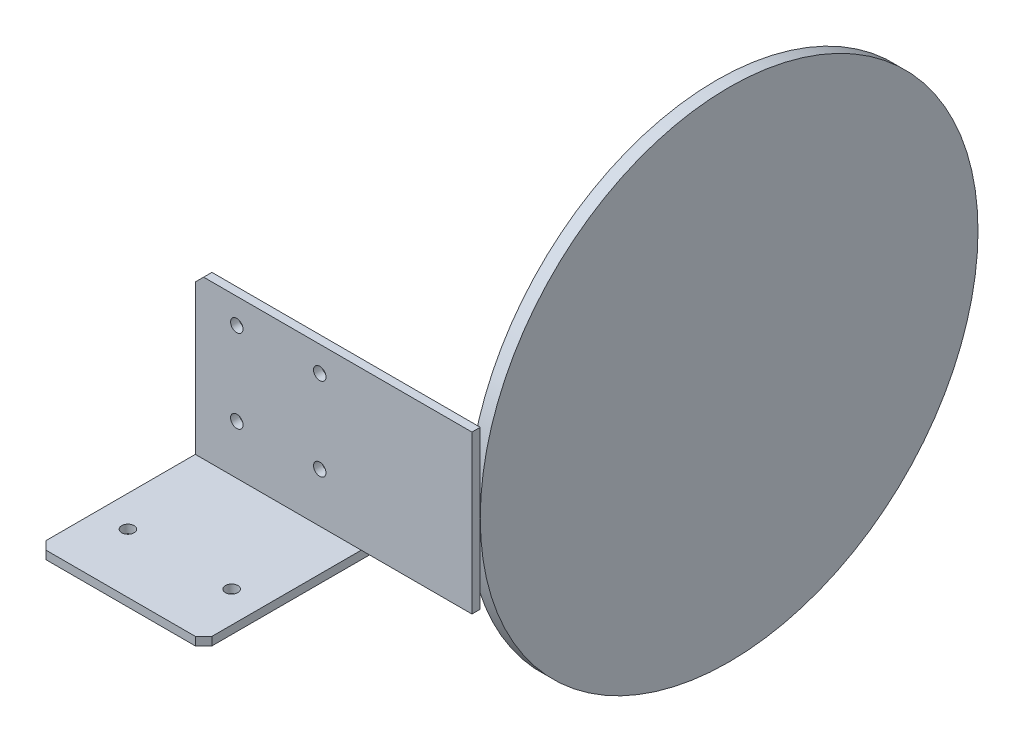
ISO-10303-21;
HEADER;
FILE_DESCRIPTION(('STEP AP214'),'2;1');
FILE_NAME('part.step','',(''),(''),'','','');
FILE_SCHEMA(('AUTOMOTIVE_DESIGN { 1 0 10303 214 1 1 1 1 }'));
ENDSEC;
DATA;
#1=APPLICATION_CONTEXT('core data for automotive mechanical design processes');
#2=APPLICATION_PROTOCOL_DEFINITION('international standard','automotive_design',2000,#1);
#3=PRODUCT_CONTEXT('',#1,'mechanical');
#4=PRODUCT('Part','Part','',(#3));
#5=PRODUCT_RELATED_PRODUCT_CATEGORY('part','',(#4));
#6=PRODUCT_DEFINITION_FORMATION('','',#4);
#7=PRODUCT_DEFINITION_CONTEXT('part definition',#1,'design');
#8=PRODUCT_DEFINITION('design','',#6,#7);
#9=PRODUCT_DEFINITION_SHAPE('','',#8);
#10=(LENGTH_UNIT() NAMED_UNIT(*) SI_UNIT(.MILLI.,.METRE.));
#11=(NAMED_UNIT(*) PLANE_ANGLE_UNIT() SI_UNIT($,.RADIAN.));
#12=(NAMED_UNIT(*) SI_UNIT($,.STERADIAN.) SOLID_ANGLE_UNIT());
#13=UNCERTAINTY_MEASURE_WITH_UNIT(LENGTH_MEASURE(1.E-05),#10,'distance_accuracy_value','');
#14=(GEOMETRIC_REPRESENTATION_CONTEXT(3) GLOBAL_UNCERTAINTY_ASSIGNED_CONTEXT((#13)) GLOBAL_UNIT_ASSIGNED_CONTEXT((#10,
#11,#12)) REPRESENTATION_CONTEXT('',''));
#15=CARTESIAN_POINT('',(0.,0.,0.));
#16=DIRECTION('',(0.,0.,1.));
#17=DIRECTION('',(1.,0.,0.));
#18=AXIS2_PLACEMENT_3D('',#15,#16,#17);
#19=CARTESIAN_POINT('',(63.69,19.,-62.));
#20=DIRECTION('',(1.,0.,0.));
#21=DIRECTION('',(0.,0.,-1.));
#22=AXIS2_PLACEMENT_3D('',#19,#20,#21);
#23=CYLINDRICAL_SURFACE('',#22,59.9999999999999);
#24=CARTESIAN_POINT('',(63.69,19.,-62.));
#25=DIRECTION('',(1.,0.,0.));
#26=DIRECTION('',(0.,0.,-1.));
#27=AXIS2_PLACEMENT_3D('',#24,#25,#26);
#28=CIRCLE('',#27,59.9999999999999);
#29=CARTESIAN_POINT('',(63.69,19.,-122.));
#30=VERTEX_POINT('',#29);
#31=EDGE_CURVE('E11',#30,#30,#28,.T.);
#32=ORIENTED_EDGE('',*,*,#31,.T.);
#33=EDGE_LOOP('',(#32));
#34=FACE_BOUND('',#33,.T.);
#35=CARTESIAN_POINT('',(66.69,19.,-62.));
#36=DIRECTION('',(1.,0.,0.));
#37=DIRECTION('',(0.,0.,-1.));
#38=AXIS2_PLACEMENT_3D('',#35,#36,#37);
#39=CIRCLE('',#38,59.9999999999999);
#40=CARTESIAN_POINT('',(66.69,19.,-122.));
#41=VERTEX_POINT('',#40);
#42=EDGE_CURVE('E46',#41,#41,#39,.T.);
#43=ORIENTED_EDGE('',*,*,#42,.F.);
#44=EDGE_LOOP('',(#43));
#45=FACE_BOUND('',#44,.T.);
#46=ADVANCED_FACE('F43',(#34,#45),#23,.T.);
#47=CARTESIAN_POINT('',(63.69,19.,-62.));
#48=DIRECTION('',(1.,0.,0.));
#49=DIRECTION('',(0.,0.,-1.));
#50=AXIS2_PLACEMENT_3D('',#47,#48,#49);
#51=PLANE('',#50);
#52=ORIENTED_EDGE('',*,*,#31,.F.);
#53=EDGE_LOOP('',(#52));
#54=FACE_BOUND('',#53,.T.);
#55=ADVANCED_FACE('F58',(#54),#51,.F.);
#56=CARTESIAN_POINT('',(66.69,19.,-62.));
#57=DIRECTION('',(1.,0.,0.));
#58=DIRECTION('',(0.,0.,-1.));
#59=AXIS2_PLACEMENT_3D('',#56,#57,#58);
#60=PLANE('',#59);
#61=ORIENTED_EDGE('',*,*,#42,.T.);
#62=EDGE_LOOP('',(#61));
#63=FACE_BOUND('',#62,.T.);
#64=ADVANCED_FACE('F55',(#63),#60,.T.);
#65=CLOSED_SHELL('',(#46,#55,#64));
#66=MANIFOLD_SOLID_BREP('B2',#65);
#67=CARTESIAN_POINT('',(40.,0.,38.));
#68=DIRECTION('',(0.,-1.,0.));
#69=DIRECTION('',(0.,0.,-1.));
#70=AXIS2_PLACEMENT_3D('',#67,#68,#69);
#71=PLANE('',#70);
#72=CARTESIAN_POINT('',(7.5,0.,23.75));
#73=DIRECTION('',(0.,-1.,0.));
#74=DIRECTION('',(0.,0.,-1.));
#75=AXIS2_PLACEMENT_3D('',#72,#73,#74);
#76=CIRCLE('',#75,1.49999999997635);
#77=CARTESIAN_POINT('',(7.5,0.,22.2500000000236));
#78=VERTEX_POINT('',#77);
#79=EDGE_CURVE('E219',#78,#78,#76,.F.);
#80=ORIENTED_EDGE('',*,*,#79,.F.);
#81=EDGE_LOOP('',(#80));
#82=FACE_BOUND('',#81,.T.);
#83=CARTESIAN_POINT('',(32.5,0.,23.75));
#84=DIRECTION('',(0.,-1.,0.));
#85=DIRECTION('',(0.,0.,-1.));
#86=AXIS2_PLACEMENT_3D('',#83,#84,#85);
#87=CIRCLE('',#86,1.49999999997635);
#88=CARTESIAN_POINT('',(32.5,0.,22.2500000000236));
#89=VERTEX_POINT('',#88);
#90=EDGE_CURVE('E225',#89,#89,#87,.F.);
#91=ORIENTED_EDGE('',*,*,#90,.F.);
#92=EDGE_LOOP('',(#91));
#93=FACE_BOUND('',#92,.T.);
#94=DIRECTION('',(-1.,0.,0.));
#95=VECTOR('',#94,1.);
#96=CARTESIAN_POINT('',(40.,0.,38.));
#97=LINE('',#96,#95);
#98=CARTESIAN_POINT('',(38.,0.,38.));
#99=VERTEX_POINT('',#98);
#100=CARTESIAN_POINT('',(2.00000000000001,0.,38.));
#101=VERTEX_POINT('',#100);
#102=EDGE_CURVE('E255',#99,#101,#97,.T.);
#103=ORIENTED_EDGE('',*,*,#102,.F.);
#104=DIRECTION('',(0.70710678118655,0.,-0.707106781186545));
#105=VECTOR('',#104,1.);
#106=CARTESIAN_POINT('',(40.,0.,36.));
#107=LINE('',#106,#105);
#108=CARTESIAN_POINT('',(40.,0.,36.));
#109=VERTEX_POINT('',#108);
#110=EDGE_CURVE('E272',#99,#109,#107,.T.);
#111=ORIENTED_EDGE('',*,*,#110,.T.);
#112=DIRECTION('',(0.,0.,1.));
#113=VECTOR('',#112,1.);
#114=CARTESIAN_POINT('',(40.,0.,38.));
#115=LINE('',#114,#113);
#116=CARTESIAN_POINT('',(40.,0.,0.));
#117=VERTEX_POINT('',#116);
#118=EDGE_CURVE('E229',#117,#109,#115,.T.);
#119=ORIENTED_EDGE('',*,*,#118,.F.);
#120=DIRECTION('',(-1.,0.,0.));
#121=VECTOR('',#120,1.);
#122=CARTESIAN_POINT('',(40.,0.,0.));
#123=LINE('',#122,#121);
#124=CARTESIAN_POINT('',(0.,0.,0.));
#125=VERTEX_POINT('',#124);
#126=EDGE_CURVE('E169',#117,#125,#123,.T.);
#127=ORIENTED_EDGE('',*,*,#126,.T.);
#128=DIRECTION('',(0.,0.,1.));
#129=VECTOR('',#128,1.);
#130=CARTESIAN_POINT('',(0.,0.,38.));
#131=LINE('',#130,#129);
#132=CARTESIAN_POINT('',(0.,0.,36.));
#133=VERTEX_POINT('',#132);
#134=EDGE_CURVE('E228',#125,#133,#131,.T.);
#135=ORIENTED_EDGE('',*,*,#134,.T.);
#136=DIRECTION('',(-0.707106781186545,0.,-0.70710678118655));
#137=VECTOR('',#136,1.);
#138=CARTESIAN_POINT('',(1.99999999999999,0.,38.));
#139=LINE('',#138,#137);
#140=EDGE_CURVE('E270',#133,#101,#139,.F.);
#141=ORIENTED_EDGE('',*,*,#140,.T.);
#142=EDGE_LOOP('',(#103,#111,#119,#127,#135,#141));
#143=FACE_BOUND('',#142,.T.);
#144=ADVANCED_FACE('F84',(#82,#93,#143),#71,.F.);
#145=CARTESIAN_POINT('',(40.,-2.,38.));
#146=DIRECTION('',(0.,0.,-1.));
#147=DIRECTION('',(-1.,0.,0.));
#148=AXIS2_PLACEMENT_3D('',#145,#146,#147);
#149=PLANE('',#148);
#150=DIRECTION('',(-1.,0.,0.));
#151=VECTOR('',#150,1.);
#152=CARTESIAN_POINT('',(40.,-2.,38.));
#153=LINE('',#152,#151);
#154=CARTESIAN_POINT('',(38.,-2.,38.));
#155=VERTEX_POINT('',#154);
#156=CARTESIAN_POINT('',(2.00000000000001,-2.,38.));
#157=VERTEX_POINT('',#156);
#158=EDGE_CURVE('E252',#155,#157,#153,.T.);
#159=ORIENTED_EDGE('',*,*,#158,.F.);
#160=DIRECTION('',(0.,1.,0.));
#161=VECTOR('',#160,1.);
#162=CARTESIAN_POINT('',(38.,0.,38.));
#163=LINE('',#162,#161);
#164=EDGE_CURVE('E268',#155,#99,#163,.T.);
#165=ORIENTED_EDGE('',*,*,#164,.T.);
#166=ORIENTED_EDGE('',*,*,#102,.T.);
#167=DIRECTION('',(0.,-1.,0.));
#168=VECTOR('',#167,1.);
#169=CARTESIAN_POINT('',(1.99999999999999,-2.,38.));
#170=LINE('',#169,#168);
#171=EDGE_CURVE('E265',#101,#157,#170,.T.);
#172=ORIENTED_EDGE('',*,*,#171,.T.);
#173=EDGE_LOOP('',(#159,#165,#166,#172));
#174=FACE_BOUND('',#173,.T.);
#175=ADVANCED_FACE('F301',(#174),#149,.F.);
#176=CARTESIAN_POINT('',(40.,-2.,-2.00000000000001));
#177=DIRECTION('',(0.,1.,0.));
#178=DIRECTION('',(0.,0.,1.));
#179=AXIS2_PLACEMENT_3D('',#176,#177,#178);
#180=PLANE('',#179);
#181=CARTESIAN_POINT('',(7.5,-2.,23.75));
#182=DIRECTION('',(0.,-1.,0.));
#183=DIRECTION('',(0.,0.,-1.));
#184=AXIS2_PLACEMENT_3D('',#181,#182,#183);
#185=CIRCLE('',#184,1.49999999997635);
#186=CARTESIAN_POINT('',(7.5,-2.,22.2500000000236));
#187=VERTEX_POINT('',#186);
#188=EDGE_CURVE('E216',#187,#187,#185,.T.);
#189=ORIENTED_EDGE('',*,*,#188,.F.);
#190=EDGE_LOOP('',(#189));
#191=FACE_BOUND('',#190,.T.);
#192=CARTESIAN_POINT('',(32.5,-2.,23.75));
#193=DIRECTION('',(0.,-1.,0.));
#194=DIRECTION('',(0.,0.,-1.));
#195=AXIS2_PLACEMENT_3D('',#192,#193,#194);
#196=CIRCLE('',#195,1.49999999997635);
#197=CARTESIAN_POINT('',(32.5,-2.,22.2500000000236));
#198=VERTEX_POINT('',#197);
#199=EDGE_CURVE('E222',#198,#198,#196,.T.);
#200=ORIENTED_EDGE('',*,*,#199,.F.);
#201=EDGE_LOOP('',(#200));
#202=FACE_BOUND('',#201,.T.);
#203=DIRECTION('',(0.,0.,-1.));
#204=VECTOR('',#203,1.);
#205=CARTESIAN_POINT('',(40.,-2.,-2.00000000000001));
#206=LINE('',#205,#204);
#207=CARTESIAN_POINT('',(40.,-2.,36.));
#208=VERTEX_POINT('',#207);
#209=CARTESIAN_POINT('',(40.,-2.,-2.00000000000001));
#210=VERTEX_POINT('',#209);
#211=EDGE_CURVE('E232',#208,#210,#206,.T.);
#212=ORIENTED_EDGE('',*,*,#211,.F.);
#213=DIRECTION('',(-0.70710678118655,0.,0.707106781186545));
#214=VECTOR('',#213,1.);
#215=CARTESIAN_POINT('',(40.,-2.,36.));
#216=LINE('',#215,#214);
#217=EDGE_CURVE('E263',#208,#155,#216,.T.);
#218=ORIENTED_EDGE('',*,*,#217,.T.);
#219=ORIENTED_EDGE('',*,*,#158,.T.);
#220=DIRECTION('',(0.707106781186545,0.,0.70710678118655));
#221=VECTOR('',#220,1.);
#222=CARTESIAN_POINT('',(1.99999999999999,-2.,38.));
#223=LINE('',#222,#221);
#224=CARTESIAN_POINT('',(0.,-2.,36.));
#225=VERTEX_POINT('',#224);
#226=EDGE_CURVE('E261',#157,#225,#223,.F.);
#227=ORIENTED_EDGE('',*,*,#226,.T.);
#228=DIRECTION('',(0.,0.,-1.));
#229=VECTOR('',#228,1.);
#230=CARTESIAN_POINT('',(0.,-2.,-2.00000000000001));
#231=LINE('',#230,#229);
#232=CARTESIAN_POINT('',(0.,-2.,-2.00000000000001));
#233=VERTEX_POINT('',#232);
#234=EDGE_CURVE('E240',#225,#233,#231,.T.);
#235=ORIENTED_EDGE('',*,*,#234,.T.);
#236=DIRECTION('',(-1.,0.,0.));
#237=VECTOR('',#236,1.);
#238=CARTESIAN_POINT('',(40.,-2.,-2.00000000000001));
#239=LINE('',#238,#237);
#240=EDGE_CURVE('E249',#210,#233,#239,.T.);
#241=ORIENTED_EDGE('',*,*,#240,.F.);
#242=EDGE_LOOP('',(#212,#218,#219,#227,#235,#241));
#243=FACE_BOUND('',#242,.T.);
#244=ADVANCED_FACE('F298',(#191,#202,#243),#180,.F.);
#245=CARTESIAN_POINT('',(40.,38.,-2.));
#246=DIRECTION('',(0.,0.,1.));
#247=DIRECTION('',(0.,-1.,0.));
#248=AXIS2_PLACEMENT_3D('',#245,#246,#247);
#249=PLANE('',#248);
#250=DIRECTION('',(1.,0.,0.));
#251=VECTOR('',#250,1.);
#252=CARTESIAN_POINT('',(37.,0.,-2.00000000000001));
#253=LINE('',#252,#251);
#254=CARTESIAN_POINT('',(40.,0.,-2.00000000000001));
#255=VERTEX_POINT('',#254);
#256=CARTESIAN_POINT('',(66.69,0.,-2.00000000000001));
#257=VERTEX_POINT('',#256);
#258=EDGE_CURVE('E173',#255,#257,#253,.T.);
#259=ORIENTED_EDGE('',*,*,#258,.F.);
#260=DIRECTION('',(0.,1.,0.));
#261=VECTOR('',#260,1.);
#262=CARTESIAN_POINT('',(40.,38.,-2.));
#263=LINE('',#262,#261);
#264=EDGE_CURVE('E235',#210,#255,#263,.T.);
#265=ORIENTED_EDGE('',*,*,#264,.F.);
#266=ORIENTED_EDGE('',*,*,#240,.T.);
#267=DIRECTION('',(0.,1.,0.));
#268=VECTOR('',#267,1.);
#269=CARTESIAN_POINT('',(0.,38.,-2.));
#270=LINE('',#269,#268);
#271=CARTESIAN_POINT('',(0.,36.,-2.));
#272=VERTEX_POINT('',#271);
#273=EDGE_CURVE('E242',#233,#272,#270,.T.);
#274=ORIENTED_EDGE('',*,*,#273,.T.);
#275=DIRECTION('',(-0.707106781186545,-0.70710678118655,0.));
#276=VECTOR('',#275,1.);
#277=CARTESIAN_POINT('',(1.99999999999999,38.,-2.));
#278=LINE('',#277,#276);
#279=CARTESIAN_POINT('',(2.00000000000001,38.,-2.));
#280=VERTEX_POINT('',#279);
#281=EDGE_CURVE('E92',#272,#280,#278,.F.);
#282=ORIENTED_EDGE('',*,*,#281,.T.);
#283=DIRECTION('',(-1.,0.,0.));
#284=VECTOR('',#283,1.);
#285=CARTESIAN_POINT('',(40.,38.,-2.));
#286=LINE('',#285,#284);
#287=CARTESIAN_POINT('',(66.69,38.,-2.00000000000001));
#288=VERTEX_POINT('',#287);
#289=EDGE_CURVE('E99',#288,#280,#286,.T.);
#290=ORIENTED_EDGE('',*,*,#289,.F.);
#291=DIRECTION('',(0.,1.,0.));
#292=VECTOR('',#291,1.);
#293=CARTESIAN_POINT('',(66.69,38.,-2.00000000000001));
#294=LINE('',#293,#292);
#295=EDGE_CURVE('E183',#257,#288,#294,.T.);
#296=ORIENTED_EDGE('',*,*,#295,.F.);
#297=EDGE_LOOP('',(#259,#265,#266,#274,#282,#290,#296));
#298=FACE_BOUND('',#297,.T.);
#299=CARTESIAN_POINT('',(9.99999999999981,11.9,-2.));
#300=DIRECTION('',(0.,0.,-1.));
#301=DIRECTION('',(0.,1.,0.));
#302=AXIS2_PLACEMENT_3D('',#299,#300,#301);
#303=CIRCLE('',#302,1.5);
#304=CARTESIAN_POINT('',(9.99999999999981,13.4,-2.));
#305=VERTEX_POINT('',#304);
#306=EDGE_CURVE('E191',#305,#305,#303,.T.);
#307=ORIENTED_EDGE('',*,*,#306,.F.);
#308=EDGE_LOOP('',(#307));
#309=FACE_BOUND('',#308,.T.);
#310=CARTESIAN_POINT('',(29.9999999999998,11.8999999999999,-2.));
#311=DIRECTION('',(0.,0.,-1.));
#312=DIRECTION('',(0.,1.,0.));
#313=AXIS2_PLACEMENT_3D('',#310,#311,#312);
#314=CIRCLE('',#313,1.5);
#315=CARTESIAN_POINT('',(29.9999999999998,13.3999999999999,-2.));
#316=VERTEX_POINT('',#315);
#317=EDGE_CURVE('E198',#316,#316,#314,.T.);
#318=ORIENTED_EDGE('',*,*,#317,.F.);
#319=EDGE_LOOP('',(#318));
#320=FACE_BOUND('',#319,.T.);
#321=CARTESIAN_POINT('',(30.,31.8999999999999,-2.));
#322=DIRECTION('',(0.,0.,-1.));
#323=DIRECTION('',(0.,1.,0.));
#324=AXIS2_PLACEMENT_3D('',#321,#322,#323);
#325=CIRCLE('',#324,1.5);
#326=CARTESIAN_POINT('',(30.,33.3999999999999,-2.));
#327=VERTEX_POINT('',#326);
#328=EDGE_CURVE('E204',#327,#327,#325,.T.);
#329=ORIENTED_EDGE('',*,*,#328,.F.);
#330=EDGE_LOOP('',(#329));
#331=FACE_BOUND('',#330,.T.);
#332=CARTESIAN_POINT('',(10.,31.9,-2.));
#333=DIRECTION('',(0.,0.,-1.));
#334=DIRECTION('',(0.,1.,0.));
#335=AXIS2_PLACEMENT_3D('',#332,#333,#334);
#336=CIRCLE('',#335,1.5);
#337=CARTESIAN_POINT('',(10.,33.4,-2.));
#338=VERTEX_POINT('',#337);
#339=EDGE_CURVE('E210',#338,#338,#336,.T.);
#340=ORIENTED_EDGE('',*,*,#339,.F.);
#341=EDGE_LOOP('',(#340));
#342=FACE_BOUND('',#341,.T.);
#343=ADVANCED_FACE('F284',(#298,#309,#320,#331,#342),#249,.F.);
#344=CARTESIAN_POINT('',(40.,38.,0.));
#345=DIRECTION('',(0.,-1.,0.));
#346=DIRECTION('',(0.,0.,-1.));
#347=AXIS2_PLACEMENT_3D('',#344,#345,#346);
#348=PLANE('',#347);
#349=ORIENTED_EDGE('',*,*,#289,.T.);
#350=DIRECTION('',(0.,0.,1.));
#351=VECTOR('',#350,1.);
#352=CARTESIAN_POINT('',(1.99999999999999,38.,0.));
#353=LINE('',#352,#351);
#354=CARTESIAN_POINT('',(2.00000000000001,38.,0.));
#355=VERTEX_POINT('',#354);
#356=EDGE_CURVE('E278',#280,#355,#353,.T.);
#357=ORIENTED_EDGE('',*,*,#356,.T.);
#358=DIRECTION('',(-1.,0.,0.));
#359=VECTOR('',#358,1.);
#360=CARTESIAN_POINT('',(40.,38.,0.));
#361=LINE('',#360,#359);
#362=CARTESIAN_POINT('',(66.69,38.,0.));
#363=VERTEX_POINT('',#362);
#364=EDGE_CURVE('E107',#363,#355,#361,.T.);
#365=ORIENTED_EDGE('',*,*,#364,.F.);
#366=DIRECTION('',(0.,0.,1.));
#367=VECTOR('',#366,1.);
#368=CARTESIAN_POINT('',(66.69,38.,0.));
#369=LINE('',#368,#367);
#370=EDGE_CURVE('E174',#288,#363,#369,.T.);
#371=ORIENTED_EDGE('',*,*,#370,.F.);
#372=EDGE_LOOP('',(#349,#357,#365,#371));
#373=FACE_BOUND('',#372,.T.);
#374=ADVANCED_FACE('F289',(#373),#348,.F.);
#375=CARTESIAN_POINT('',(40.,0.,0.));
#376=DIRECTION('',(0.,0.,-1.));
#377=DIRECTION('',(-1.,0.,0.));
#378=AXIS2_PLACEMENT_3D('',#375,#376,#377);
#379=PLANE('',#378);
#380=ORIENTED_EDGE('',*,*,#126,.F.);
#381=DIRECTION('',(1.,0.,0.));
#382=VECTOR('',#381,1.);
#383=CARTESIAN_POINT('',(37.,0.,0.));
#384=LINE('',#383,#382);
#385=CARTESIAN_POINT('',(66.69,0.,0.));
#386=VERTEX_POINT('',#385);
#387=EDGE_CURVE('E162',#117,#386,#384,.T.);
#388=ORIENTED_EDGE('',*,*,#387,.T.);
#389=DIRECTION('',(0.,-1.,0.));
#390=VECTOR('',#389,1.);
#391=CARTESIAN_POINT('',(66.69,38.,0.));
#392=LINE('',#391,#390);
#393=EDGE_CURVE('E167',#363,#386,#392,.T.);
#394=ORIENTED_EDGE('',*,*,#393,.F.);
#395=ORIENTED_EDGE('',*,*,#364,.T.);
#396=DIRECTION('',(0.707106781186545,0.70710678118655,0.));
#397=VECTOR('',#396,1.);
#398=CARTESIAN_POINT('',(1.99999999999999,38.,0.));
#399=LINE('',#398,#397);
#400=CARTESIAN_POINT('',(0.,36.,0.));
#401=VERTEX_POINT('',#400);
#402=EDGE_CURVE('E280',#355,#401,#399,.F.);
#403=ORIENTED_EDGE('',*,*,#402,.T.);
#404=DIRECTION('',(0.,-1.,0.));
#405=VECTOR('',#404,1.);
#406=CARTESIAN_POINT('',(0.,0.,0.));
#407=LINE('',#406,#405);
#408=EDGE_CURVE('E233',#401,#125,#407,.T.);
#409=ORIENTED_EDGE('',*,*,#408,.T.);
#410=EDGE_LOOP('',(#380,#388,#394,#395,#403,#409));
#411=FACE_BOUND('',#410,.T.);
#412=CARTESIAN_POINT('',(10.,31.9,0.));
#413=DIRECTION('',(0.,0.,-1.));
#414=DIRECTION('',(-1.,0.,0.));
#415=AXIS2_PLACEMENT_3D('',#412,#413,#414);
#416=CIRCLE('',#415,1.5);
#417=CARTESIAN_POINT('',(8.50000000000001,31.9,0.));
#418=VERTEX_POINT('',#417);
#419=EDGE_CURVE('E213',#418,#418,#416,.F.);
#420=ORIENTED_EDGE('',*,*,#419,.F.);
#421=EDGE_LOOP('',(#420));
#422=FACE_BOUND('',#421,.T.);
#423=CARTESIAN_POINT('',(30.,31.8999999999999,0.));
#424=DIRECTION('',(0.,0.,-1.));
#425=DIRECTION('',(-1.,0.,0.));
#426=AXIS2_PLACEMENT_3D('',#423,#424,#425);
#427=CIRCLE('',#426,1.5);
#428=CARTESIAN_POINT('',(28.5,31.8999999999999,0.));
#429=VERTEX_POINT('',#428);
#430=EDGE_CURVE('E207',#429,#429,#427,.F.);
#431=ORIENTED_EDGE('',*,*,#430,.F.);
#432=EDGE_LOOP('',(#431));
#433=FACE_BOUND('',#432,.T.);
#434=CARTESIAN_POINT('',(29.9999999999998,11.8999999999999,0.));
#435=DIRECTION('',(0.,0.,-1.));
#436=DIRECTION('',(-1.,0.,0.));
#437=AXIS2_PLACEMENT_3D('',#434,#435,#436);
#438=CIRCLE('',#437,1.5);
#439=CARTESIAN_POINT('',(28.4999999999998,11.8999999999999,0.));
#440=VERTEX_POINT('',#439);
#441=EDGE_CURVE('E201',#440,#440,#438,.F.);
#442=ORIENTED_EDGE('',*,*,#441,.F.);
#443=EDGE_LOOP('',(#442));
#444=FACE_BOUND('',#443,.T.);
#445=CARTESIAN_POINT('',(9.99999999999981,11.9,0.));
#446=DIRECTION('',(0.,0.,-1.));
#447=DIRECTION('',(-1.,0.,0.));
#448=AXIS2_PLACEMENT_3D('',#445,#446,#447);
#449=CIRCLE('',#448,1.5);
#450=CARTESIAN_POINT('',(8.4999999999998,11.9,0.));
#451=VERTEX_POINT('',#450);
#452=EDGE_CURVE('E195',#451,#451,#449,.F.);
#453=ORIENTED_EDGE('',*,*,#452,.F.);
#454=EDGE_LOOP('',(#453));
#455=FACE_BOUND('',#454,.T.);
#456=ADVANCED_FACE('F164',(#411,#422,#433,#444,#455),#379,.F.);
#457=CARTESIAN_POINT('',(40.,0.,0.));
#458=DIRECTION('',(1.,0.,0.));
#459=DIRECTION('',(0.,0.,-1.));
#460=AXIS2_PLACEMENT_3D('',#457,#458,#459);
#461=PLANE('',#460);
#462=DIRECTION('',(0.,0.,-1.));
#463=VECTOR('',#462,1.);
#464=CARTESIAN_POINT('',(40.,0.,0.));
#465=LINE('',#464,#463);
#466=EDGE_CURVE('E41',#117,#255,#465,.T.);
#467=ORIENTED_EDGE('',*,*,#466,.F.);
#468=ORIENTED_EDGE('',*,*,#118,.T.);
#469=DIRECTION('',(0.,-1.,0.));
#470=VECTOR('',#469,1.);
#471=CARTESIAN_POINT('',(40.,-2.,36.));
#472=LINE('',#471,#470);
#473=EDGE_CURVE('E258',#109,#208,#472,.T.);
#474=ORIENTED_EDGE('',*,*,#473,.T.);
#475=ORIENTED_EDGE('',*,*,#211,.T.);
#476=ORIENTED_EDGE('',*,*,#264,.T.);
#477=EDGE_LOOP('',(#467,#468,#474,#475,#476));
#478=FACE_BOUND('',#477,.T.);
#479=ADVANCED_FACE('F296',(#478),#461,.T.);
#480=CARTESIAN_POINT('',(0.,0.,0.));
#481=DIRECTION('',(1.,0.,0.));
#482=DIRECTION('',(0.,0.,-1.));
#483=AXIS2_PLACEMENT_3D('',#480,#481,#482);
#484=PLANE('',#483);
#485=ORIENTED_EDGE('',*,*,#234,.F.);
#486=DIRECTION('',(0.,1.,0.));
#487=VECTOR('',#486,1.);
#488=CARTESIAN_POINT('',(0.,0.,36.));
#489=LINE('',#488,#487);
#490=EDGE_CURVE('E276',#225,#133,#489,.T.);
#491=ORIENTED_EDGE('',*,*,#490,.T.);
#492=ORIENTED_EDGE('',*,*,#134,.F.);
#493=ORIENTED_EDGE('',*,*,#408,.F.);
#494=DIRECTION('',(0.,0.,-1.));
#495=VECTOR('',#494,1.);
#496=CARTESIAN_POINT('',(0.,36.,0.));
#497=LINE('',#496,#495);
#498=EDGE_CURVE('E274',#401,#272,#497,.T.);
#499=ORIENTED_EDGE('',*,*,#498,.T.);
#500=ORIENTED_EDGE('',*,*,#273,.F.);
#501=EDGE_LOOP('',(#485,#491,#492,#493,#499,#500));
#502=FACE_BOUND('',#501,.T.);
#503=ADVANCED_FACE('F342',(#502),#484,.F.);
#504=CARTESIAN_POINT('',(32.5,38.001,23.75));
#505=DIRECTION('',(0.,-1.,0.));
#506=DIRECTION('',(0.,0.,-1.));
#507=AXIS2_PLACEMENT_3D('',#504,#505,#506);
#508=CYLINDRICAL_SURFACE('',#507,1.49999999997635);
#509=ORIENTED_EDGE('',*,*,#199,.T.);
#510=EDGE_LOOP('',(#509));
#511=FACE_BOUND('',#510,.T.);
#512=ORIENTED_EDGE('',*,*,#90,.T.);
#513=EDGE_LOOP('',(#512));
#514=FACE_BOUND('',#513,.T.);
#515=ADVANCED_FACE('F353',(#511,#514),#508,.F.);
#516=CARTESIAN_POINT('',(7.5,38.001,23.75));
#517=DIRECTION('',(0.,-1.,0.));
#518=DIRECTION('',(0.,0.,-1.));
#519=AXIS2_PLACEMENT_3D('',#516,#517,#518);
#520=CYLINDRICAL_SURFACE('',#519,1.49999999997635);
#521=ORIENTED_EDGE('',*,*,#188,.T.);
#522=EDGE_LOOP('',(#521));
#523=FACE_BOUND('',#522,.T.);
#524=ORIENTED_EDGE('',*,*,#79,.T.);
#525=EDGE_LOOP('',(#524));
#526=FACE_BOUND('',#525,.T.);
#527=ADVANCED_FACE('F356',(#523,#526),#520,.F.);
#528=CARTESIAN_POINT('',(10.,31.9,38.001));
#529=DIRECTION('',(0.,0.,-1.));
#530=DIRECTION('',(0.,1.,0.));
#531=AXIS2_PLACEMENT_3D('',#528,#529,#530);
#532=CYLINDRICAL_SURFACE('',#531,1.5);
#533=ORIENTED_EDGE('',*,*,#339,.T.);
#534=EDGE_LOOP('',(#533));
#535=FACE_BOUND('',#534,.T.);
#536=ORIENTED_EDGE('',*,*,#419,.T.);
#537=EDGE_LOOP('',(#536));
#538=FACE_BOUND('',#537,.T.);
#539=ADVANCED_FACE('F363',(#535,#538),#532,.F.);
#540=CARTESIAN_POINT('',(30.,31.8999999999999,38.001));
#541=DIRECTION('',(0.,0.,-1.));
#542=DIRECTION('',(0.,1.,0.));
#543=AXIS2_PLACEMENT_3D('',#540,#541,#542);
#544=CYLINDRICAL_SURFACE('',#543,1.5);
#545=ORIENTED_EDGE('',*,*,#328,.T.);
#546=EDGE_LOOP('',(#545));
#547=FACE_BOUND('',#546,.T.);
#548=ORIENTED_EDGE('',*,*,#430,.T.);
#549=EDGE_LOOP('',(#548));
#550=FACE_BOUND('',#549,.T.);
#551=ADVANCED_FACE('F399',(#547,#550),#544,.F.);
#552=CARTESIAN_POINT('',(29.9999999999998,11.8999999999999,38.001));
#553=DIRECTION('',(0.,0.,-1.));
#554=DIRECTION('',(0.,1.,0.));
#555=AXIS2_PLACEMENT_3D('',#552,#553,#554);
#556=CYLINDRICAL_SURFACE('',#555,1.5);
#557=ORIENTED_EDGE('',*,*,#317,.T.);
#558=EDGE_LOOP('',(#557));
#559=FACE_BOUND('',#558,.T.);
#560=ORIENTED_EDGE('',*,*,#441,.T.);
#561=EDGE_LOOP('',(#560));
#562=FACE_BOUND('',#561,.T.);
#563=ADVANCED_FACE('F395',(#559,#562),#556,.F.);
#564=CARTESIAN_POINT('',(9.99999999999981,11.9,38.001));
#565=DIRECTION('',(0.,0.,-1.));
#566=DIRECTION('',(0.,1.,0.));
#567=AXIS2_PLACEMENT_3D('',#564,#565,#566);
#568=CYLINDRICAL_SURFACE('',#567,1.5);
#569=ORIENTED_EDGE('',*,*,#306,.T.);
#570=EDGE_LOOP('',(#569));
#571=FACE_BOUND('',#570,.T.);
#572=ORIENTED_EDGE('',*,*,#452,.T.);
#573=EDGE_LOOP('',(#572));
#574=FACE_BOUND('',#573,.T.);
#575=ADVANCED_FACE('F318',(#571,#574),#568,.F.);
#576=CARTESIAN_POINT('',(40.,0.,36.));
#577=DIRECTION('',(0.707106781186545,0.,0.70710678118655));
#578=DIRECTION('',(0.,1.,0.));
#579=AXIS2_PLACEMENT_3D('',#576,#577,#578);
#580=PLANE('',#579);
#581=ORIENTED_EDGE('',*,*,#110,.F.);
#582=ORIENTED_EDGE('',*,*,#164,.F.);
#583=ORIENTED_EDGE('',*,*,#217,.F.);
#584=ORIENTED_EDGE('',*,*,#473,.F.);
#585=EDGE_LOOP('',(#581,#582,#583,#584));
#586=FACE_BOUND('',#585,.T.);
#587=ADVANCED_FACE('F315',(#586),#580,.T.);
#588=CARTESIAN_POINT('',(1.99999999999999,-2.,38.));
#589=DIRECTION('',(0.70710678118655,0.,-0.707106781186545));
#590=DIRECTION('',(0.,-1.,0.));
#591=AXIS2_PLACEMENT_3D('',#588,#589,#590);
#592=PLANE('',#591);
#593=ORIENTED_EDGE('',*,*,#140,.F.);
#594=ORIENTED_EDGE('',*,*,#490,.F.);
#595=ORIENTED_EDGE('',*,*,#226,.F.);
#596=ORIENTED_EDGE('',*,*,#171,.F.);
#597=EDGE_LOOP('',(#593,#594,#595,#596));
#598=FACE_BOUND('',#597,.T.);
#599=ADVANCED_FACE('F317',(#598),#592,.F.);
#600=CARTESIAN_POINT('',(1.99999999999999,38.,0.));
#601=DIRECTION('',(0.70710678118655,-0.707106781186545,0.));
#602=DIRECTION('',(0.,0.,1.));
#603=AXIS2_PLACEMENT_3D('',#600,#601,#602);
#604=PLANE('',#603);
#605=ORIENTED_EDGE('',*,*,#281,.F.);
#606=ORIENTED_EDGE('',*,*,#498,.F.);
#607=ORIENTED_EDGE('',*,*,#402,.F.);
#608=ORIENTED_EDGE('',*,*,#356,.F.);
#609=EDGE_LOOP('',(#605,#606,#607,#608));
#610=FACE_BOUND('',#609,.T.);
#611=ADVANCED_FACE('F86',(#610),#604,.F.);
#612=CARTESIAN_POINT('',(37.,0.,0.));
#613=DIRECTION('',(0.,-1.,0.));
#614=DIRECTION('',(0.,0.,-1.));
#615=AXIS2_PLACEMENT_3D('',#612,#613,#614);
#616=PLANE('',#615);
#617=ORIENTED_EDGE('',*,*,#387,.F.);
#618=ORIENTED_EDGE('',*,*,#466,.T.);
#619=ORIENTED_EDGE('',*,*,#258,.T.);
#620=DIRECTION('',(0.,0.,-1.));
#621=VECTOR('',#620,1.);
#622=CARTESIAN_POINT('',(66.69,0.,0.));
#623=LINE('',#622,#621);
#624=EDGE_CURVE('E177',#386,#257,#623,.T.);
#625=ORIENTED_EDGE('',*,*,#624,.F.);
#626=EDGE_LOOP('',(#617,#618,#619,#625));
#627=FACE_BOUND('',#626,.T.);
#628=ADVANCED_FACE('F178',(#627),#616,.T.);
#629=CARTESIAN_POINT('',(66.69,0.,0.));
#630=DIRECTION('',(1.,0.,0.));
#631=DIRECTION('',(0.,0.,-1.));
#632=AXIS2_PLACEMENT_3D('',#629,#630,#631);
#633=PLANE('',#632);
#634=ORIENTED_EDGE('',*,*,#393,.T.);
#635=ORIENTED_EDGE('',*,*,#624,.T.);
#636=ORIENTED_EDGE('',*,*,#295,.T.);
#637=ORIENTED_EDGE('',*,*,#370,.T.);
#638=EDGE_LOOP('',(#634,#635,#636,#637));
#639=FACE_BOUND('',#638,.T.);
#640=ADVANCED_FACE('F186',(#639),#633,.T.);
#641=CLOSED_SHELL('',(#144,#175,#244,#343,#374,#456,#479,#503,#515,#527,#539,#551,#563,#575,
#587,#599,#611,#628,#640));
#642=MANIFOLD_SOLID_BREP('B6',#641);
#643=ADVANCED_BREP_SHAPE_REPRESENTATION('',(#18,#66,#642),#14);
#644=SHAPE_DEFINITION_REPRESENTATION(#9,#643);
ENDSEC;
END-ISO-10303-21;
